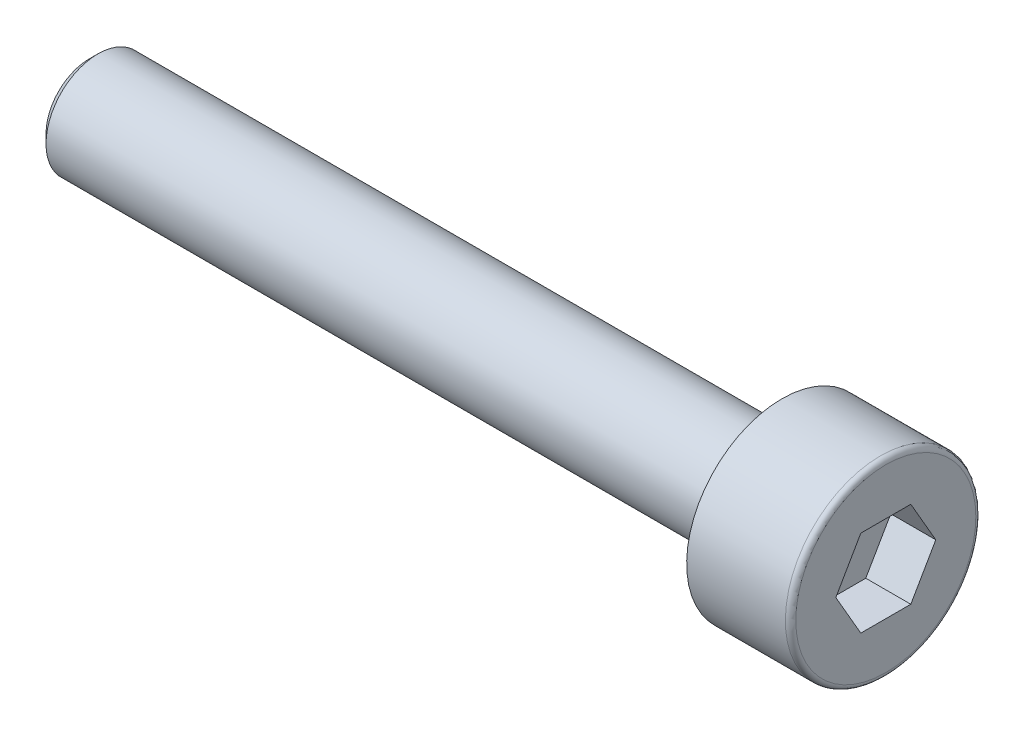
ISO-10303-21;
HEADER;
FILE_DESCRIPTION(('STEP AP214'),'2;1');
FILE_NAME('part.step','',(''),(''),'','','');
FILE_SCHEMA(('AUTOMOTIVE_DESIGN { 1 0 10303 214 1 1 1 1 }'));
ENDSEC;
DATA;
#1=APPLICATION_CONTEXT('core data for automotive mechanical design processes');
#2=APPLICATION_PROTOCOL_DEFINITION('international standard','automotive_design',2000,#1);
#3=PRODUCT_CONTEXT('',#1,'mechanical');
#4=PRODUCT('Part','Part','',(#3));
#5=PRODUCT_RELATED_PRODUCT_CATEGORY('part','',(#4));
#6=PRODUCT_DEFINITION_FORMATION('','',#4);
#7=PRODUCT_DEFINITION_CONTEXT('part definition',#1,'design');
#8=PRODUCT_DEFINITION('design','',#6,#7);
#9=PRODUCT_DEFINITION_SHAPE('','',#8);
#10=(LENGTH_UNIT() NAMED_UNIT(*) SI_UNIT(.MILLI.,.METRE.));
#11=(NAMED_UNIT(*) PLANE_ANGLE_UNIT() SI_UNIT($,.RADIAN.));
#12=(NAMED_UNIT(*) SI_UNIT($,.STERADIAN.) SOLID_ANGLE_UNIT());
#13=UNCERTAINTY_MEASURE_WITH_UNIT(LENGTH_MEASURE(1.E-05),#10,'distance_accuracy_value','');
#14=(GEOMETRIC_REPRESENTATION_CONTEXT(3) GLOBAL_UNCERTAINTY_ASSIGNED_CONTEXT((#13)) GLOBAL_UNIT_ASSIGNED_CONTEXT((#10,
#11,#12)) REPRESENTATION_CONTEXT('',''));
#15=CARTESIAN_POINT('',(0.,0.,0.));
#16=DIRECTION('',(0.,0.,1.));
#17=DIRECTION('',(1.,0.,0.));
#18=AXIS2_PLACEMENT_3D('',#15,#16,#17);
#19=CARTESIAN_POINT('',(0.,0.,0.));
#20=DIRECTION('',(1.,0.,0.));
#21=DIRECTION('',(0.,1.,0.));
#22=AXIS2_PLACEMENT_3D('',#19,#20,#21);
#23=PLANE('',#22);
#24=DIRECTION('',(0.,-0.866025403784439,0.5));
#25=VECTOR('',#24,1.);
#26=CARTESIAN_POINT('',(0.,1.25,0.721687836487035));
#27=LINE('',#26,#25);
#28=CARTESIAN_POINT('',(0.,1.25,0.721687836487035));
#29=VERTEX_POINT('',#28);
#30=CARTESIAN_POINT('',(0.,0.,1.44337567297407));
#31=VERTEX_POINT('',#30);
#32=EDGE_CURVE('E30',#29,#31,#27,.T.);
#33=ORIENTED_EDGE('',*,*,#32,.F.);
#34=DIRECTION('',(0.,0.,1.));
#35=VECTOR('',#34,1.);
#36=CARTESIAN_POINT('',(0.,1.25,-0.721687836487035));
#37=LINE('',#36,#35);
#38=CARTESIAN_POINT('',(0.,1.25,-0.721687836487035));
#39=VERTEX_POINT('',#38);
#40=EDGE_CURVE('E113',#39,#29,#37,.T.);
#41=ORIENTED_EDGE('',*,*,#40,.F.);
#42=DIRECTION('',(0.,0.866025403784439,0.5));
#43=VECTOR('',#42,1.);
#44=CARTESIAN_POINT('',(0.,0.,-1.44337567297406));
#45=LINE('',#44,#43);
#46=CARTESIAN_POINT('',(0.,0.,-1.44337567297406));
#47=VERTEX_POINT('',#46);
#48=EDGE_CURVE('E111',#47,#39,#45,.T.);
#49=ORIENTED_EDGE('',*,*,#48,.F.);
#50=DIRECTION('',(0.,0.866025403784439,-0.5));
#51=VECTOR('',#50,1.);
#52=CARTESIAN_POINT('',(0.,-1.25,-0.721687836487029));
#53=LINE('',#52,#51);
#54=CARTESIAN_POINT('',(0.,-1.25,-0.721687836487029));
#55=VERTEX_POINT('',#54);
#56=EDGE_CURVE('E78',#55,#47,#53,.T.);
#57=ORIENTED_EDGE('',*,*,#56,.F.);
#58=DIRECTION('',(0.,0.,-1.));
#59=VECTOR('',#58,1.);
#60=CARTESIAN_POINT('',(0.,-1.25,0.721687836487035));
#61=LINE('',#60,#59);
#62=CARTESIAN_POINT('',(0.,-1.25,0.721687836487035));
#63=VERTEX_POINT('',#62);
#64=EDGE_CURVE('E107',#63,#55,#61,.T.);
#65=ORIENTED_EDGE('',*,*,#64,.F.);
#66=DIRECTION('',(0.,-0.866025403784439,-0.5));
#67=VECTOR('',#66,1.);
#68=CARTESIAN_POINT('',(0.,0.,1.44337567297407));
#69=LINE('',#68,#67);
#70=EDGE_CURVE('E104',#31,#63,#69,.T.);
#71=ORIENTED_EDGE('',*,*,#70,.F.);
#72=EDGE_LOOP('',(#33,#41,#49,#57,#65,#71));
#73=FACE_BOUND('',#72,.T.);
#74=CARTESIAN_POINT('',(0.,0.,0.));
#75=DIRECTION('',(1.,0.,0.));
#76=DIRECTION('',(0.,1.,0.));
#77=AXIS2_PLACEMENT_3D('',#74,#75,#76);
#78=CIRCLE('',#77,2.6);
#79=CARTESIAN_POINT('',(0.,2.6,0.));
#80=VERTEX_POINT('',#79);
#81=EDGE_CURVE('E131',#80,#80,#78,.T.);
#82=ORIENTED_EDGE('',*,*,#81,.T.);
#83=EDGE_LOOP('',(#82));
#84=FACE_BOUND('',#83,.T.);
#85=ADVANCED_FACE('F15',(#73,#84),#23,.T.);
#86=CARTESIAN_POINT('',(-0.15,0.,0.));
#87=DIRECTION('',(1.,0.,0.));
#88=DIRECTION('',(0.,1.,0.));
#89=AXIS2_PLACEMENT_3D('',#86,#87,#88);
#90=TOROIDAL_SURFACE('',#89,2.6,0.15);
#91=CARTESIAN_POINT('',(-0.15,0.,0.));
#92=DIRECTION('',(1.,0.,0.));
#93=DIRECTION('',(0.,1.,0.));
#94=AXIS2_PLACEMENT_3D('',#91,#92,#93);
#95=CIRCLE('',#94,2.75);
#96=CARTESIAN_POINT('',(-0.15,2.75,0.));
#97=VERTEX_POINT('',#96);
#98=EDGE_CURVE('E128',#97,#97,#95,.T.);
#99=ORIENTED_EDGE('',*,*,#98,.T.);
#100=EDGE_LOOP('',(#99));
#101=FACE_BOUND('',#100,.T.);
#102=ORIENTED_EDGE('',*,*,#81,.F.);
#103=EDGE_LOOP('',(#102));
#104=FACE_BOUND('',#103,.T.);
#105=ADVANCED_FACE('F150',(#101,#104),#90,.T.);
#106=CARTESIAN_POINT('',(0.,0.,0.));
#107=DIRECTION('',(1.,0.,0.));
#108=DIRECTION('',(0.,1.,0.));
#109=AXIS2_PLACEMENT_3D('',#106,#107,#108);
#110=CYLINDRICAL_SURFACE('',#109,2.75);
#111=CARTESIAN_POINT('',(-3.,0.,0.));
#112=DIRECTION('',(1.,0.,0.));
#113=DIRECTION('',(0.,1.,0.));
#114=AXIS2_PLACEMENT_3D('',#111,#112,#113);
#115=CIRCLE('',#114,2.75);
#116=CARTESIAN_POINT('',(-3.,2.75,0.));
#117=VERTEX_POINT('',#116);
#118=EDGE_CURVE('E125',#117,#117,#115,.T.);
#119=ORIENTED_EDGE('',*,*,#118,.T.);
#120=EDGE_LOOP('',(#119));
#121=FACE_BOUND('',#120,.T.);
#122=ORIENTED_EDGE('',*,*,#98,.F.);
#123=EDGE_LOOP('',(#122));
#124=FACE_BOUND('',#123,.T.);
#125=ADVANCED_FACE('F156',(#121,#124),#110,.T.);
#126=CARTESIAN_POINT('',(-3.,2.75,0.));
#127=DIRECTION('',(-1.,0.,0.));
#128=DIRECTION('',(0.,-1.,0.));
#129=AXIS2_PLACEMENT_3D('',#126,#127,#128);
#130=PLANE('',#129);
#131=CARTESIAN_POINT('',(-3.,0.,0.));
#132=DIRECTION('',(1.,0.,0.));
#133=DIRECTION('',(0.,1.,0.));
#134=AXIS2_PLACEMENT_3D('',#131,#132,#133);
#135=CIRCLE('',#134,1.5);
#136=CARTESIAN_POINT('',(-3.,1.5,0.));
#137=VERTEX_POINT('',#136);
#138=EDGE_CURVE('E117',#137,#137,#135,.T.);
#139=ORIENTED_EDGE('',*,*,#138,.T.);
#140=EDGE_LOOP('',(#139));
#141=FACE_BOUND('',#140,.T.);
#142=ORIENTED_EDGE('',*,*,#118,.F.);
#143=EDGE_LOOP('',(#142));
#144=FACE_BOUND('',#143,.T.);
#145=ADVANCED_FACE('F163',(#141,#144),#130,.T.);
#146=CARTESIAN_POINT('',(0.,0.,0.));
#147=DIRECTION('',(1.,0.,0.));
#148=DIRECTION('',(0.,1.,0.));
#149=AXIS2_PLACEMENT_3D('',#146,#147,#148);
#150=CYLINDRICAL_SURFACE('',#149,1.5);
#151=CARTESIAN_POINT('',(-22.75,0.,0.));
#152=DIRECTION('',(-1.,0.,0.));
#153=DIRECTION('',(0.,-1.,0.));
#154=AXIS2_PLACEMENT_3D('',#151,#152,#153);
#155=CIRCLE('',#154,1.5);
#156=CARTESIAN_POINT('',(-22.75,-1.5,0.));
#157=VERTEX_POINT('',#156);
#158=EDGE_CURVE('E23',#157,#157,#155,.F.);
#159=ORIENTED_EDGE('',*,*,#158,.T.);
#160=EDGE_LOOP('',(#159));
#161=FACE_BOUND('',#160,.T.);
#162=ORIENTED_EDGE('',*,*,#138,.F.);
#163=EDGE_LOOP('',(#162));
#164=FACE_BOUND('',#163,.T.);
#165=ADVANCED_FACE('F136',(#161,#164),#150,.T.);
#166=CARTESIAN_POINT('',(-23.,1.5,0.));
#167=DIRECTION('',(-1.,0.,0.));
#168=DIRECTION('',(0.,-1.,0.));
#169=AXIS2_PLACEMENT_3D('',#166,#167,#168);
#170=PLANE('',#169);
#171=CARTESIAN_POINT('',(-23.,0.,0.));
#172=DIRECTION('',(-1.,0.,0.));
#173=DIRECTION('',(0.,-1.,0.));
#174=AXIS2_PLACEMENT_3D('',#171,#172,#173);
#175=CIRCLE('',#174,1.25);
#176=CARTESIAN_POINT('',(-23.,-1.25,0.));
#177=VERTEX_POINT('',#176);
#178=EDGE_CURVE('E9',#177,#177,#175,.T.);
#179=ORIENTED_EDGE('',*,*,#178,.T.);
#180=EDGE_LOOP('',(#179));
#181=FACE_BOUND('',#180,.T.);
#182=ADVANCED_FACE('F170',(#181),#170,.T.);
#183=CARTESIAN_POINT('',(-1.3,1.25,0.721687836487035));
#184=DIRECTION('',(0.,0.5,0.866025403784439));
#185=DIRECTION('',(0.,-0.866025403784439,0.5));
#186=AXIS2_PLACEMENT_3D('',#183,#184,#185);
#187=PLANE('',#186);
#188=ORIENTED_EDGE('',*,*,#32,.T.);
#189=DIRECTION('',(1.,0.,0.));
#190=VECTOR('',#189,1.);
#191=CARTESIAN_POINT('',(-1.3,0.,1.44337567297407));
#192=LINE('',#191,#190);
#193=CARTESIAN_POINT('',(-1.3,0.,1.44337567297407));
#194=VERTEX_POINT('',#193);
#195=EDGE_CURVE('E60',#194,#31,#192,.T.);
#196=ORIENTED_EDGE('',*,*,#195,.F.);
#197=DIRECTION('',(0.,-0.866025403784439,0.5));
#198=VECTOR('',#197,1.);
#199=CARTESIAN_POINT('',(-1.3,1.25,0.721687836487035));
#200=LINE('',#199,#198);
#201=CARTESIAN_POINT('',(-1.3,1.25,0.721687836487035));
#202=VERTEX_POINT('',#201);
#203=EDGE_CURVE('E115',#202,#194,#200,.T.);
#204=ORIENTED_EDGE('',*,*,#203,.F.);
#205=DIRECTION('',(1.,0.,0.));
#206=VECTOR('',#205,1.);
#207=CARTESIAN_POINT('',(-1.3,1.25,0.721687836487035));
#208=LINE('',#207,#206);
#209=EDGE_CURVE('E38',#202,#29,#208,.T.);
#210=ORIENTED_EDGE('',*,*,#209,.T.);
#211=EDGE_LOOP('',(#188,#196,#204,#210));
#212=FACE_BOUND('',#211,.T.);
#213=ADVANCED_FACE('F173',(#212),#187,.F.);
#214=CARTESIAN_POINT('',(-1.3,1.25,-0.721687836487035));
#215=DIRECTION('',(0.,1.,0.));
#216=DIRECTION('',(-1.,0.,0.));
#217=AXIS2_PLACEMENT_3D('',#214,#215,#216);
#218=PLANE('',#217);
#219=ORIENTED_EDGE('',*,*,#40,.T.);
#220=ORIENTED_EDGE('',*,*,#209,.F.);
#221=DIRECTION('',(0.,0.,1.));
#222=VECTOR('',#221,1.);
#223=CARTESIAN_POINT('',(-1.3,1.25,-0.721687836487035));
#224=LINE('',#223,#222);
#225=CARTESIAN_POINT('',(-1.3,1.25,-0.721687836487035));
#226=VERTEX_POINT('',#225);
#227=EDGE_CURVE('E90',#226,#202,#224,.T.);
#228=ORIENTED_EDGE('',*,*,#227,.F.);
#229=DIRECTION('',(1.,0.,0.));
#230=VECTOR('',#229,1.);
#231=CARTESIAN_POINT('',(-1.3,1.25,-0.721687836487035));
#232=LINE('',#231,#230);
#233=EDGE_CURVE('E82',#226,#39,#232,.T.);
#234=ORIENTED_EDGE('',*,*,#233,.T.);
#235=EDGE_LOOP('',(#219,#220,#228,#234));
#236=FACE_BOUND('',#235,.T.);
#237=ADVANCED_FACE('F177',(#236),#218,.F.);
#238=CARTESIAN_POINT('',(-1.3,0.,-1.44337567297406));
#239=DIRECTION('',(0.,0.5,-0.866025403784439));
#240=DIRECTION('',(0.,0.866025403784439,0.5));
#241=AXIS2_PLACEMENT_3D('',#238,#239,#240);
#242=PLANE('',#241);
#243=ORIENTED_EDGE('',*,*,#48,.T.);
#244=ORIENTED_EDGE('',*,*,#233,.F.);
#245=DIRECTION('',(0.,0.866025403784439,0.5));
#246=VECTOR('',#245,1.);
#247=CARTESIAN_POINT('',(-1.3,0.,-1.44337567297406));
#248=LINE('',#247,#246);
#249=CARTESIAN_POINT('',(-1.3,0.,-1.44337567297406));
#250=VERTEX_POINT('',#249);
#251=EDGE_CURVE('E86',#250,#226,#248,.T.);
#252=ORIENTED_EDGE('',*,*,#251,.F.);
#253=DIRECTION('',(1.,0.,0.));
#254=VECTOR('',#253,1.);
#255=CARTESIAN_POINT('',(-1.3,0.,-1.44337567297406));
#256=LINE('',#255,#254);
#257=EDGE_CURVE('E71',#250,#47,#256,.T.);
#258=ORIENTED_EDGE('',*,*,#257,.T.);
#259=EDGE_LOOP('',(#243,#244,#252,#258));
#260=FACE_BOUND('',#259,.T.);
#261=ADVANCED_FACE('F87',(#260),#242,.F.);
#262=CARTESIAN_POINT('',(-1.3,-1.25,-0.721687836487029));
#263=DIRECTION('',(0.,-0.5,-0.866025403784439));
#264=DIRECTION('',(0.,0.866025403784439,-0.5));
#265=AXIS2_PLACEMENT_3D('',#262,#263,#264);
#266=PLANE('',#265);
#267=ORIENTED_EDGE('',*,*,#56,.T.);
#268=ORIENTED_EDGE('',*,*,#257,.F.);
#269=DIRECTION('',(0.,0.866025403784439,-0.5));
#270=VECTOR('',#269,1.);
#271=CARTESIAN_POINT('',(-1.3,-1.25,-0.721687836487029));
#272=LINE('',#271,#270);
#273=CARTESIAN_POINT('',(-1.3,-1.25,-0.721687836487029));
#274=VERTEX_POINT('',#273);
#275=EDGE_CURVE('E75',#274,#250,#272,.T.);
#276=ORIENTED_EDGE('',*,*,#275,.F.);
#277=DIRECTION('',(1.,0.,0.));
#278=VECTOR('',#277,1.);
#279=CARTESIAN_POINT('',(-1.3,-1.25,-0.721687836487029));
#280=LINE('',#279,#278);
#281=EDGE_CURVE('E83',#274,#55,#280,.T.);
#282=ORIENTED_EDGE('',*,*,#281,.T.);
#283=EDGE_LOOP('',(#267,#268,#276,#282));
#284=FACE_BOUND('',#283,.T.);
#285=ADVANCED_FACE('F73',(#284),#266,.F.);
#286=CARTESIAN_POINT('',(-1.3,-1.25,0.721687836487035));
#287=DIRECTION('',(0.,-1.,0.));
#288=DIRECTION('',(0.,0.,-1.));
#289=AXIS2_PLACEMENT_3D('',#286,#287,#288);
#290=PLANE('',#289);
#291=ORIENTED_EDGE('',*,*,#64,.T.);
#292=ORIENTED_EDGE('',*,*,#281,.F.);
#293=DIRECTION('',(0.,0.,-1.));
#294=VECTOR('',#293,1.);
#295=CARTESIAN_POINT('',(-1.3,-1.25,0.721687836487035));
#296=LINE('',#295,#294);
#297=CARTESIAN_POINT('',(-1.3,-1.25,0.721687836487035));
#298=VERTEX_POINT('',#297);
#299=EDGE_CURVE('E96',#298,#274,#296,.T.);
#300=ORIENTED_EDGE('',*,*,#299,.F.);
#301=DIRECTION('',(1.,0.,0.));
#302=VECTOR('',#301,1.);
#303=CARTESIAN_POINT('',(-1.3,-1.25,0.721687836487035));
#304=LINE('',#303,#302);
#305=EDGE_CURVE('E120',#298,#63,#304,.T.);
#306=ORIENTED_EDGE('',*,*,#305,.T.);
#307=EDGE_LOOP('',(#291,#292,#300,#306));
#308=FACE_BOUND('',#307,.T.);
#309=ADVANCED_FACE('F180',(#308),#290,.F.);
#310=CARTESIAN_POINT('',(-1.3,0.,1.44337567297407));
#311=DIRECTION('',(0.,-0.5,0.866025403784439));
#312=DIRECTION('',(0.,-0.866025403784439,-0.5));
#313=AXIS2_PLACEMENT_3D('',#310,#311,#312);
#314=PLANE('',#313);
#315=ORIENTED_EDGE('',*,*,#70,.T.);
#316=ORIENTED_EDGE('',*,*,#305,.F.);
#317=DIRECTION('',(0.,-0.866025403784439,-0.5));
#318=VECTOR('',#317,1.);
#319=CARTESIAN_POINT('',(-1.3,0.,1.44337567297407));
#320=LINE('',#319,#318);
#321=EDGE_CURVE('E98',#194,#298,#320,.T.);
#322=ORIENTED_EDGE('',*,*,#321,.F.);
#323=ORIENTED_EDGE('',*,*,#195,.T.);
#324=EDGE_LOOP('',(#315,#316,#322,#323));
#325=FACE_BOUND('',#324,.T.);
#326=ADVANCED_FACE('F146',(#325),#314,.F.);
#327=CARTESIAN_POINT('',(-1.3,0.,1.44337567297407));
#328=DIRECTION('',(1.,0.,0.));
#329=DIRECTION('',(0.,1.,0.));
#330=AXIS2_PLACEMENT_3D('',#327,#328,#329);
#331=PLANE('',#330);
#332=ORIENTED_EDGE('',*,*,#203,.T.);
#333=ORIENTED_EDGE('',*,*,#321,.T.);
#334=ORIENTED_EDGE('',*,*,#299,.T.);
#335=ORIENTED_EDGE('',*,*,#275,.T.);
#336=ORIENTED_EDGE('',*,*,#251,.T.);
#337=ORIENTED_EDGE('',*,*,#227,.T.);
#338=EDGE_LOOP('',(#332,#333,#334,#335,#336,#337));
#339=FACE_BOUND('',#338,.T.);
#340=ADVANCED_FACE('F93',(#339),#331,.T.);
#341=CARTESIAN_POINT('',(-22.75,0.,0.));
#342=DIRECTION('',(1.,0.,0.));
#343=DIRECTION('',(0.,1.,0.));
#344=AXIS2_PLACEMENT_3D('',#341,#342,#343);
#345=CONICAL_SURFACE('',#344,1.5,0.785398163397452);
#346=ORIENTED_EDGE('',*,*,#178,.F.);
#347=EDGE_LOOP('',(#346));
#348=FACE_BOUND('',#347,.T.);
#349=ORIENTED_EDGE('',*,*,#158,.F.);
#350=EDGE_LOOP('',(#349));
#351=FACE_BOUND('',#350,.T.);
#352=ADVANCED_FACE('F17',(#348,#351),#345,.T.);
#353=CLOSED_SHELL('',(#85,#105,#125,#145,#165,#182,#213,#237,#261,#285,#309,#326,#340,#352));
#354=MANIFOLD_SOLID_BREP('B1',#353);
#355=ADVANCED_BREP_SHAPE_REPRESENTATION('',(#18,#354),#14);
#356=SHAPE_DEFINITION_REPRESENTATION(#9,#355);
ENDSEC;
END-ISO-10303-21;
